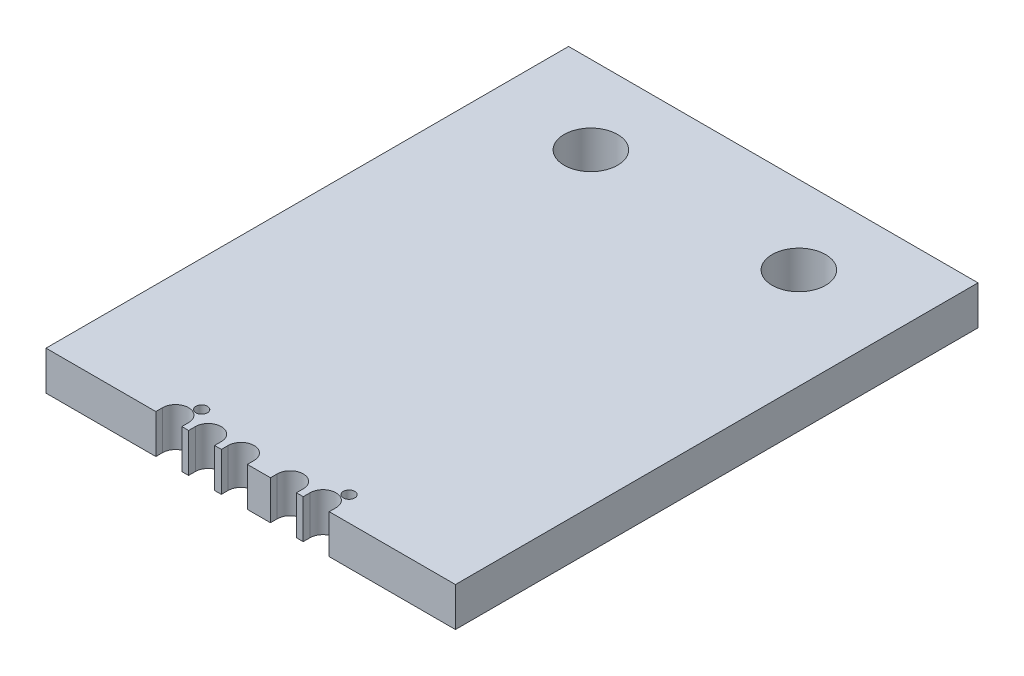
ISO-10303-21;
HEADER;
FILE_DESCRIPTION(('STEP AP214'),'2;1');
FILE_NAME('part.step','',(''),(''),'','','');
FILE_SCHEMA(('AUTOMOTIVE_DESIGN { 1 0 10303 214 1 1 1 1 }'));
ENDSEC;
DATA;
#1=APPLICATION_CONTEXT('core data for automotive mechanical design processes');
#2=APPLICATION_PROTOCOL_DEFINITION('international standard','automotive_design',2000,#1);
#3=PRODUCT_CONTEXT('',#1,'mechanical');
#4=PRODUCT('Part','Part','',(#3));
#5=PRODUCT_RELATED_PRODUCT_CATEGORY('part','',(#4));
#6=PRODUCT_DEFINITION_FORMATION('','',#4);
#7=PRODUCT_DEFINITION_CONTEXT('part definition',#1,'design');
#8=PRODUCT_DEFINITION('design','',#6,#7);
#9=PRODUCT_DEFINITION_SHAPE('','',#8);
#10=(LENGTH_UNIT() NAMED_UNIT(*) SI_UNIT(.MILLI.,.METRE.));
#11=(NAMED_UNIT(*) PLANE_ANGLE_UNIT() SI_UNIT($,.RADIAN.));
#12=(NAMED_UNIT(*) SI_UNIT($,.STERADIAN.) SOLID_ANGLE_UNIT());
#13=UNCERTAINTY_MEASURE_WITH_UNIT(LENGTH_MEASURE(1.E-05),#10,'distance_accuracy_value','');
#14=(GEOMETRIC_REPRESENTATION_CONTEXT(3) GLOBAL_UNCERTAINTY_ASSIGNED_CONTEXT((#13)) GLOBAL_UNIT_ASSIGNED_CONTEXT((#10,
#11,#12)) REPRESENTATION_CONTEXT('',''));
#15=CARTESIAN_POINT('',(0.,0.,0.));
#16=DIRECTION('',(0.,0.,1.));
#17=DIRECTION('',(1.,0.,0.));
#18=AXIS2_PLACEMENT_3D('',#15,#16,#17);
#19=CARTESIAN_POINT('',(16.,-4.7625,-1.18513126604703));
#20=DIRECTION('',(0.,0.,1.));
#21=DIRECTION('',(1.,0.,0.));
#22=AXIS2_PLACEMENT_3D('',#19,#20,#21);
#23=PLANE('',#22);
#24=DIRECTION('',(1.,0.,0.));
#25=VECTOR('',#24,1.);
#26=CARTESIAN_POINT('',(16.,0.,-1.18513126604703));
#27=LINE('',#26,#25);
#28=CARTESIAN_POINT('',(16.,0.,-1.18513126604703));
#29=VERTEX_POINT('',#28);
#30=CARTESIAN_POINT('',(29.4125,0.,-1.18513126604703));
#31=VERTEX_POINT('',#30);
#32=EDGE_CURVE('E235',#29,#31,#27,.T.);
#33=ORIENTED_EDGE('',*,*,#32,.F.);
#34=DIRECTION('',(0.,1.,0.));
#35=VECTOR('',#34,1.);
#36=CARTESIAN_POINT('',(16.,-4.7625,-1.18513126604703));
#37=LINE('',#36,#35);
#38=CARTESIAN_POINT('',(16.,-4.7625,-1.18513126604703));
#39=VERTEX_POINT('',#38);
#40=EDGE_CURVE('E13',#39,#29,#37,.T.);
#41=ORIENTED_EDGE('',*,*,#40,.F.);
#42=DIRECTION('',(1.,0.,0.));
#43=VECTOR('',#42,1.);
#44=CARTESIAN_POINT('',(16.,-4.7625,-1.18513126604703));
#45=LINE('',#44,#43);
#46=CARTESIAN_POINT('',(29.4125,-4.7625,-1.18513126604703));
#47=VERTEX_POINT('',#46);
#48=EDGE_CURVE('E304',#39,#47,#45,.T.);
#49=ORIENTED_EDGE('',*,*,#48,.T.);
#50=DIRECTION('',(0.,1.,0.));
#51=VECTOR('',#50,1.);
#52=CARTESIAN_POINT('',(29.4125,-4.7625,-1.18513126604703));
#53=LINE('',#52,#51);
#54=EDGE_CURVE('E45',#47,#31,#53,.T.);
#55=ORIENTED_EDGE('',*,*,#54,.T.);
#56=EDGE_LOOP('',(#33,#41,#49,#55));
#57=FACE_BOUND('',#56,.T.);
#58=ADVANCED_FACE('F42',(#57),#23,.T.);
#59=CARTESIAN_POINT('',(16.,-4.7625,-1.18513126604703));
#60=DIRECTION('',(-1.,0.,0.));
#61=DIRECTION('',(0.,0.,1.));
#62=AXIS2_PLACEMENT_3D('',#59,#60,#61);
#63=PLANE('',#62);
#64=DIRECTION('',(0.,0.,1.));
#65=VECTOR('',#64,1.);
#66=CARTESIAN_POINT('',(16.,0.,-1.18513126604703));
#67=LINE('',#66,#65);
#68=CARTESIAN_POINT('',(16.,0.,-65.));
#69=VERTEX_POINT('',#68);
#70=EDGE_CURVE('E302',#69,#29,#67,.T.);
#71=ORIENTED_EDGE('',*,*,#70,.F.);
#72=DIRECTION('',(0.,1.,0.));
#73=VECTOR('',#72,1.);
#74=CARTESIAN_POINT('',(16.,-4.7625,-65.));
#75=LINE('',#74,#73);
#76=CARTESIAN_POINT('',(16.,-4.7625,-65.));
#77=VERTEX_POINT('',#76);
#78=EDGE_CURVE('E51',#77,#69,#75,.T.);
#79=ORIENTED_EDGE('',*,*,#78,.F.);
#80=DIRECTION('',(0.,0.,1.));
#81=VECTOR('',#80,1.);
#82=CARTESIAN_POINT('',(16.,-4.7625,-1.18513126604703));
#83=LINE('',#82,#81);
#84=EDGE_CURVE('E225',#77,#39,#83,.T.);
#85=ORIENTED_EDGE('',*,*,#84,.T.);
#86=ORIENTED_EDGE('',*,*,#40,.T.);
#87=EDGE_LOOP('',(#71,#79,#85,#86));
#88=FACE_BOUND('',#87,.T.);
#89=ADVANCED_FACE('F348',(#88),#63,.T.);
#90=CARTESIAN_POINT('',(16.,-4.7625,-65.));
#91=DIRECTION('',(0.,0.,-1.));
#92=DIRECTION('',(-1.,0.,0.));
#93=AXIS2_PLACEMENT_3D('',#90,#91,#92);
#94=PLANE('',#93);
#95=DIRECTION('',(-1.,0.,0.));
#96=VECTOR('',#95,1.);
#97=CARTESIAN_POINT('',(16.,0.,-65.));
#98=LINE('',#97,#96);
#99=CARTESIAN_POINT('',(66.,0.,-65.));
#100=VERTEX_POINT('',#99);
#101=EDGE_CURVE('E212',#100,#69,#98,.T.);
#102=ORIENTED_EDGE('',*,*,#101,.F.);
#103=DIRECTION('',(0.,1.,0.));
#104=VECTOR('',#103,1.);
#105=CARTESIAN_POINT('',(66.,-4.7625,-65.));
#106=LINE('',#105,#104);
#107=CARTESIAN_POINT('',(66.,-4.7625,-65.));
#108=VERTEX_POINT('',#107);
#109=EDGE_CURVE('E207',#108,#100,#106,.T.);
#110=ORIENTED_EDGE('',*,*,#109,.F.);
#111=DIRECTION('',(-1.,0.,0.));
#112=VECTOR('',#111,1.);
#113=CARTESIAN_POINT('',(16.,-4.7625,-65.));
#114=LINE('',#113,#112);
#115=EDGE_CURVE('E210',#108,#77,#114,.T.);
#116=ORIENTED_EDGE('',*,*,#115,.T.);
#117=ORIENTED_EDGE('',*,*,#78,.T.);
#118=EDGE_LOOP('',(#102,#110,#116,#117));
#119=FACE_BOUND('',#118,.T.);
#120=ADVANCED_FACE('F209',(#119),#94,.T.);
#121=CARTESIAN_POINT('',(66.,-4.7625,-1.18513126604705));
#122=DIRECTION('',(1.,0.,0.));
#123=DIRECTION('',(0.,0.,-1.));
#124=AXIS2_PLACEMENT_3D('',#121,#122,#123);
#125=PLANE('',#124);
#126=DIRECTION('',(0.,0.,-1.));
#127=VECTOR('',#126,1.);
#128=CARTESIAN_POINT('',(66.,0.,-1.18513126604705));
#129=LINE('',#128,#127);
#130=CARTESIAN_POINT('',(66.,0.,-1.18513126604705));
#131=VERTEX_POINT('',#130);
#132=EDGE_CURVE('E299',#131,#100,#129,.T.);
#133=ORIENTED_EDGE('',*,*,#132,.F.);
#134=DIRECTION('',(0.,1.,0.));
#135=VECTOR('',#134,1.);
#136=CARTESIAN_POINT('',(66.,-4.7625,-1.18513126604705));
#137=LINE('',#136,#135);
#138=CARTESIAN_POINT('',(66.,-4.7625,-1.18513126604705));
#139=VERTEX_POINT('',#138);
#140=EDGE_CURVE('E217',#139,#131,#137,.T.);
#141=ORIENTED_EDGE('',*,*,#140,.F.);
#142=DIRECTION('',(0.,0.,-1.));
#143=VECTOR('',#142,1.);
#144=CARTESIAN_POINT('',(66.,-4.7625,-1.18513126604705));
#145=LINE('',#144,#143);
#146=EDGE_CURVE('E223',#139,#108,#145,.T.);
#147=ORIENTED_EDGE('',*,*,#146,.T.);
#148=ORIENTED_EDGE('',*,*,#109,.T.);
#149=EDGE_LOOP('',(#133,#141,#147,#148));
#150=FACE_BOUND('',#149,.T.);
#151=ADVANCED_FACE('F227',(#150),#125,.T.);
#152=CARTESIAN_POINT('',(50.5875,-4.7625,-1.18513126604703));
#153=DIRECTION('',(0.,0.,1.));
#154=DIRECTION('',(1.,0.,0.));
#155=AXIS2_PLACEMENT_3D('',#152,#153,#154);
#156=PLANE('',#155);
#157=DIRECTION('',(1.,0.,0.));
#158=VECTOR('',#157,1.);
#159=CARTESIAN_POINT('',(50.5875,0.,-1.18513126604703));
#160=LINE('',#159,#158);
#161=CARTESIAN_POINT('',(50.5875,0.,-1.18513126604703));
#162=VERTEX_POINT('',#161);
#163=EDGE_CURVE('E296',#162,#131,#160,.T.);
#164=ORIENTED_EDGE('',*,*,#163,.F.);
#165=DIRECTION('',(0.,1.,0.));
#166=VECTOR('',#165,1.);
#167=CARTESIAN_POINT('',(50.5875,-4.7625,-1.18513126604703));
#168=LINE('',#167,#166);
#169=CARTESIAN_POINT('',(50.5875,-4.7625,-1.18513126604703));
#170=VERTEX_POINT('',#169);
#171=EDGE_CURVE('E308',#170,#162,#168,.T.);
#172=ORIENTED_EDGE('',*,*,#171,.F.);
#173=DIRECTION('',(1.,0.,0.));
#174=VECTOR('',#173,1.);
#175=CARTESIAN_POINT('',(50.5875,-4.7625,-1.18513126604703));
#176=LINE('',#175,#174);
#177=EDGE_CURVE('E228',#170,#139,#176,.T.);
#178=ORIENTED_EDGE('',*,*,#177,.T.);
#179=ORIENTED_EDGE('',*,*,#140,.T.);
#180=EDGE_LOOP('',(#164,#172,#178,#179));
#181=FACE_BOUND('',#180,.T.);
#182=ADVANCED_FACE('F361',(#181),#156,.T.);
#183=CARTESIAN_POINT('',(50.5875,-4.7625,-2.00982745948582));
#184=DIRECTION('',(-1.,0.,0.));
#185=DIRECTION('',(0.,0.,1.));
#186=AXIS2_PLACEMENT_3D('',#183,#184,#185);
#187=PLANE('',#186);
#188=DIRECTION('',(0.,0.,1.));
#189=VECTOR('',#188,1.);
#190=CARTESIAN_POINT('',(50.5875,0.,-2.00982745948582));
#191=LINE('',#190,#189);
#192=CARTESIAN_POINT('',(50.5875,0.,-2.00982745948582));
#193=VERTEX_POINT('',#192);
#194=EDGE_CURVE('E293',#193,#162,#191,.T.);
#195=ORIENTED_EDGE('',*,*,#194,.F.);
#196=DIRECTION('',(0.,1.,0.));
#197=VECTOR('',#196,1.);
#198=CARTESIAN_POINT('',(50.5875,-4.7625,-2.00982745948582));
#199=LINE('',#198,#197);
#200=CARTESIAN_POINT('',(50.5875,-4.7625,-2.00982745948582));
#201=VERTEX_POINT('',#200);
#202=EDGE_CURVE('E310',#201,#193,#199,.T.);
#203=ORIENTED_EDGE('',*,*,#202,.F.);
#204=DIRECTION('',(0.,0.,1.));
#205=VECTOR('',#204,1.);
#206=CARTESIAN_POINT('',(50.5875,-4.7625,-2.00982745948582));
#207=LINE('',#206,#205);
#208=EDGE_CURVE('E230',#201,#170,#207,.T.);
#209=ORIENTED_EDGE('',*,*,#208,.T.);
#210=ORIENTED_EDGE('',*,*,#171,.T.);
#211=EDGE_LOOP('',(#195,#203,#209,#210));
#212=FACE_BOUND('',#211,.T.);
#213=ADVANCED_FACE('F364',(#212),#187,.T.);
#214=CARTESIAN_POINT('',(49.,-4.7625,-2.00982745948582));
#215=DIRECTION('',(0.,1.,0.));
#216=DIRECTION('',(0.,0.,1.));
#217=AXIS2_PLACEMENT_3D('',#214,#215,#216);
#218=CYLINDRICAL_SURFACE('',#217,1.5875);
#219=CARTESIAN_POINT('',(49.,0.,-2.00982745948582));
#220=DIRECTION('',(0.,-1.,0.));
#221=DIRECTION('',(0.,0.,-1.));
#222=AXIS2_PLACEMENT_3D('',#219,#220,#221);
#223=CIRCLE('',#222,1.5875);
#224=CARTESIAN_POINT('',(47.4125,0.,-2.00982745948582));
#225=VERTEX_POINT('',#224);
#226=EDGE_CURVE('E290',#225,#193,#223,.T.);
#227=ORIENTED_EDGE('',*,*,#226,.F.);
#228=DIRECTION('',(0.,1.,0.));
#229=VECTOR('',#228,1.);
#230=CARTESIAN_POINT('',(47.4125,-4.7625,-2.00982745948582));
#231=LINE('',#230,#229);
#232=CARTESIAN_POINT('',(47.4125,-4.7625,-2.00982745948582));
#233=VERTEX_POINT('',#232);
#234=EDGE_CURVE('E312',#233,#225,#231,.T.);
#235=ORIENTED_EDGE('',*,*,#234,.F.);
#236=CARTESIAN_POINT('',(49.,-4.7625,-2.00982745948582));
#237=DIRECTION('',(0.,-1.,0.));
#238=DIRECTION('',(0.,0.,-1.));
#239=AXIS2_PLACEMENT_3D('',#236,#237,#238);
#240=CIRCLE('',#239,1.5875);
#241=EDGE_CURVE('E542',#233,#201,#240,.T.);
#242=ORIENTED_EDGE('',*,*,#241,.T.);
#243=ORIENTED_EDGE('',*,*,#202,.T.);
#244=EDGE_LOOP('',(#227,#235,#242,#243));
#245=FACE_BOUND('',#244,.T.);
#246=ADVANCED_FACE('F368',(#245),#218,.F.);
#247=CARTESIAN_POINT('',(47.4125,-4.7625,-1.18513126604703));
#248=DIRECTION('',(1.,0.,0.));
#249=DIRECTION('',(0.,0.,-1.));
#250=AXIS2_PLACEMENT_3D('',#247,#248,#249);
#251=PLANE('',#250);
#252=DIRECTION('',(0.,0.,-1.));
#253=VECTOR('',#252,1.);
#254=CARTESIAN_POINT('',(47.4125,0.,-1.18513126604703));
#255=LINE('',#254,#253);
#256=CARTESIAN_POINT('',(47.4125,0.,-1.18513126604703));
#257=VERTEX_POINT('',#256);
#258=EDGE_CURVE('E287',#257,#225,#255,.T.);
#259=ORIENTED_EDGE('',*,*,#258,.F.);
#260=DIRECTION('',(0.,1.,0.));
#261=VECTOR('',#260,1.);
#262=CARTESIAN_POINT('',(47.4125,-4.7625,-1.18513126604703));
#263=LINE('',#262,#261);
#264=CARTESIAN_POINT('',(47.4125,-4.7625,-1.18513126604703));
#265=VERTEX_POINT('',#264);
#266=EDGE_CURVE('E314',#265,#257,#263,.T.);
#267=ORIENTED_EDGE('',*,*,#266,.F.);
#268=DIRECTION('',(0.,0.,-1.));
#269=VECTOR('',#268,1.);
#270=CARTESIAN_POINT('',(47.4125,-4.7625,-1.18513126604703));
#271=LINE('',#270,#269);
#272=EDGE_CURVE('E539',#265,#233,#271,.T.);
#273=ORIENTED_EDGE('',*,*,#272,.T.);
#274=ORIENTED_EDGE('',*,*,#234,.T.);
#275=EDGE_LOOP('',(#259,#267,#273,#274));
#276=FACE_BOUND('',#275,.T.);
#277=ADVANCED_FACE('F372',(#276),#251,.T.);
#278=CARTESIAN_POINT('',(46.5875,-4.7625,-1.18513126604703));
#279=DIRECTION('',(0.,0.,1.));
#280=DIRECTION('',(1.,0.,0.));
#281=AXIS2_PLACEMENT_3D('',#278,#279,#280);
#282=PLANE('',#281);
#283=DIRECTION('',(1.,0.,0.));
#284=VECTOR('',#283,1.);
#285=CARTESIAN_POINT('',(46.5875,0.,-1.18513126604703));
#286=LINE('',#285,#284);
#287=CARTESIAN_POINT('',(46.5875,0.,-1.18513126604703));
#288=VERTEX_POINT('',#287);
#289=EDGE_CURVE('E284',#288,#257,#286,.T.);
#290=ORIENTED_EDGE('',*,*,#289,.F.);
#291=DIRECTION('',(0.,1.,0.));
#292=VECTOR('',#291,1.);
#293=CARTESIAN_POINT('',(46.5875,-4.7625,-1.18513126604703));
#294=LINE('',#293,#292);
#295=CARTESIAN_POINT('',(46.5875,-4.7625,-1.18513126604703));
#296=VERTEX_POINT('',#295);
#297=EDGE_CURVE('E316',#296,#288,#294,.T.);
#298=ORIENTED_EDGE('',*,*,#297,.F.);
#299=DIRECTION('',(1.,0.,0.));
#300=VECTOR('',#299,1.);
#301=CARTESIAN_POINT('',(46.5875,-4.7625,-1.18513126604703));
#302=LINE('',#301,#300);
#303=EDGE_CURVE('E536',#296,#265,#302,.T.);
#304=ORIENTED_EDGE('',*,*,#303,.T.);
#305=ORIENTED_EDGE('',*,*,#266,.T.);
#306=EDGE_LOOP('',(#290,#298,#304,#305));
#307=FACE_BOUND('',#306,.T.);
#308=ADVANCED_FACE('F376',(#307),#282,.T.);
#309=CARTESIAN_POINT('',(46.5875,-4.7625,-2.00982745948582));
#310=DIRECTION('',(-1.,0.,0.));
#311=DIRECTION('',(0.,0.,1.));
#312=AXIS2_PLACEMENT_3D('',#309,#310,#311);
#313=PLANE('',#312);
#314=DIRECTION('',(0.,0.,1.));
#315=VECTOR('',#314,1.);
#316=CARTESIAN_POINT('',(46.5875,0.,-2.00982745948582));
#317=LINE('',#316,#315);
#318=CARTESIAN_POINT('',(46.5875,0.,-2.00982745948582));
#319=VERTEX_POINT('',#318);
#320=EDGE_CURVE('E281',#319,#288,#317,.T.);
#321=ORIENTED_EDGE('',*,*,#320,.F.);
#322=DIRECTION('',(0.,1.,0.));
#323=VECTOR('',#322,1.);
#324=CARTESIAN_POINT('',(46.5875,-4.7625,-2.00982745948582));
#325=LINE('',#324,#323);
#326=CARTESIAN_POINT('',(46.5875,-4.7625,-2.00982745948582));
#327=VERTEX_POINT('',#326);
#328=EDGE_CURVE('E318',#327,#319,#325,.T.);
#329=ORIENTED_EDGE('',*,*,#328,.F.);
#330=DIRECTION('',(0.,0.,1.));
#331=VECTOR('',#330,1.);
#332=CARTESIAN_POINT('',(46.5875,-4.7625,-2.00982745948582));
#333=LINE('',#332,#331);
#334=EDGE_CURVE('E533',#327,#296,#333,.T.);
#335=ORIENTED_EDGE('',*,*,#334,.T.);
#336=ORIENTED_EDGE('',*,*,#297,.T.);
#337=EDGE_LOOP('',(#321,#329,#335,#336));
#338=FACE_BOUND('',#337,.T.);
#339=ADVANCED_FACE('F380',(#338),#313,.T.);
#340=CARTESIAN_POINT('',(45.,-4.7625,-2.00982745948582));
#341=DIRECTION('',(0.,1.,0.));
#342=DIRECTION('',(0.,0.,1.));
#343=AXIS2_PLACEMENT_3D('',#340,#341,#342);
#344=CYLINDRICAL_SURFACE('',#343,1.5875);
#345=CARTESIAN_POINT('',(45.,0.,-2.00982745948582));
#346=DIRECTION('',(0.,-1.,0.));
#347=DIRECTION('',(0.,0.,-1.));
#348=AXIS2_PLACEMENT_3D('',#345,#346,#347);
#349=CIRCLE('',#348,1.5875);
#350=CARTESIAN_POINT('',(43.4125,0.,-2.00982745948582));
#351=VERTEX_POINT('',#350);
#352=EDGE_CURVE('E278',#351,#319,#349,.T.);
#353=ORIENTED_EDGE('',*,*,#352,.F.);
#354=DIRECTION('',(0.,1.,0.));
#355=VECTOR('',#354,1.);
#356=CARTESIAN_POINT('',(43.4125,-4.7625,-2.00982745948582));
#357=LINE('',#356,#355);
#358=CARTESIAN_POINT('',(43.4125,-4.7625,-2.00982745948582));
#359=VERTEX_POINT('',#358);
#360=EDGE_CURVE('E320',#359,#351,#357,.T.);
#361=ORIENTED_EDGE('',*,*,#360,.F.);
#362=CARTESIAN_POINT('',(45.,-4.7625,-2.00982745948582));
#363=DIRECTION('',(0.,-1.,0.));
#364=DIRECTION('',(0.,0.,-1.));
#365=AXIS2_PLACEMENT_3D('',#362,#363,#364);
#366=CIRCLE('',#365,1.5875);
#367=EDGE_CURVE('E530',#359,#327,#366,.T.);
#368=ORIENTED_EDGE('',*,*,#367,.T.);
#369=ORIENTED_EDGE('',*,*,#328,.T.);
#370=EDGE_LOOP('',(#353,#361,#368,#369));
#371=FACE_BOUND('',#370,.T.);
#372=ADVANCED_FACE('F384',(#371),#344,.F.);
#373=CARTESIAN_POINT('',(43.4125,-4.7625,-2.00982745948582));
#374=DIRECTION('',(1.,0.,0.));
#375=DIRECTION('',(0.,0.,-1.));
#376=AXIS2_PLACEMENT_3D('',#373,#374,#375);
#377=PLANE('',#376);
#378=DIRECTION('',(0.,0.,-1.));
#379=VECTOR('',#378,1.);
#380=CARTESIAN_POINT('',(43.4125,0.,-2.00982745948582));
#381=LINE('',#380,#379);
#382=CARTESIAN_POINT('',(43.4125,0.,-1.18513126604703));
#383=VERTEX_POINT('',#382);
#384=EDGE_CURVE('E275',#383,#351,#381,.T.);
#385=ORIENTED_EDGE('',*,*,#384,.F.);
#386=DIRECTION('',(0.,1.,0.));
#387=VECTOR('',#386,1.);
#388=CARTESIAN_POINT('',(43.4125,-4.7625,-1.18513126604703));
#389=LINE('',#388,#387);
#390=CARTESIAN_POINT('',(43.4125,-4.7625,-1.18513126604703));
#391=VERTEX_POINT('',#390);
#392=EDGE_CURVE('E322',#391,#383,#389,.T.);
#393=ORIENTED_EDGE('',*,*,#392,.F.);
#394=DIRECTION('',(0.,0.,-1.));
#395=VECTOR('',#394,1.);
#396=CARTESIAN_POINT('',(43.4125,-4.7625,-2.00982745948582));
#397=LINE('',#396,#395);
#398=EDGE_CURVE('E527',#391,#359,#397,.T.);
#399=ORIENTED_EDGE('',*,*,#398,.T.);
#400=ORIENTED_EDGE('',*,*,#360,.T.);
#401=EDGE_LOOP('',(#385,#393,#399,#400));
#402=FACE_BOUND('',#401,.T.);
#403=ADVANCED_FACE('F388',(#402),#377,.T.);
#404=CARTESIAN_POINT('',(43.4125,-4.7625,-1.18513126604703));
#405=DIRECTION('',(0.,0.,1.));
#406=DIRECTION('',(1.,0.,0.));
#407=AXIS2_PLACEMENT_3D('',#404,#405,#406);
#408=PLANE('',#407);
#409=DIRECTION('',(1.,0.,0.));
#410=VECTOR('',#409,1.);
#411=CARTESIAN_POINT('',(43.4125,0.,-1.18513126604703));
#412=LINE('',#411,#410);
#413=CARTESIAN_POINT('',(40.5875,0.,-1.18513126604703));
#414=VERTEX_POINT('',#413);
#415=EDGE_CURVE('E272',#414,#383,#412,.T.);
#416=ORIENTED_EDGE('',*,*,#415,.F.);
#417=DIRECTION('',(0.,1.,0.));
#418=VECTOR('',#417,1.);
#419=CARTESIAN_POINT('',(40.5875,-4.7625,-1.18513126604703));
#420=LINE('',#419,#418);
#421=CARTESIAN_POINT('',(40.5875,-4.7625,-1.18513126604703));
#422=VERTEX_POINT('',#421);
#423=EDGE_CURVE('E324',#422,#414,#420,.T.);
#424=ORIENTED_EDGE('',*,*,#423,.F.);
#425=DIRECTION('',(1.,0.,0.));
#426=VECTOR('',#425,1.);
#427=CARTESIAN_POINT('',(43.4125,-4.7625,-1.18513126604703));
#428=LINE('',#427,#426);
#429=EDGE_CURVE('E524',#422,#391,#428,.T.);
#430=ORIENTED_EDGE('',*,*,#429,.T.);
#431=ORIENTED_EDGE('',*,*,#392,.T.);
#432=EDGE_LOOP('',(#416,#424,#430,#431));
#433=FACE_BOUND('',#432,.T.);
#434=ADVANCED_FACE('F392',(#433),#408,.T.);
#435=CARTESIAN_POINT('',(40.5875,-4.7625,-1.18513126604703));
#436=DIRECTION('',(-1.,0.,0.));
#437=DIRECTION('',(0.,0.,1.));
#438=AXIS2_PLACEMENT_3D('',#435,#436,#437);
#439=PLANE('',#438);
#440=DIRECTION('',(0.,0.,1.));
#441=VECTOR('',#440,1.);
#442=CARTESIAN_POINT('',(40.5875,0.,-1.18513126604703));
#443=LINE('',#442,#441);
#444=CARTESIAN_POINT('',(40.5875,0.,-2.00982745948582));
#445=VERTEX_POINT('',#444);
#446=EDGE_CURVE('E269',#445,#414,#443,.T.);
#447=ORIENTED_EDGE('',*,*,#446,.F.);
#448=DIRECTION('',(0.,1.,0.));
#449=VECTOR('',#448,1.);
#450=CARTESIAN_POINT('',(40.5875,-4.7625,-2.00982745948582));
#451=LINE('',#450,#449);
#452=CARTESIAN_POINT('',(40.5875,-4.7625,-2.00982745948582));
#453=VERTEX_POINT('',#452);
#454=EDGE_CURVE('E326',#453,#445,#451,.T.);
#455=ORIENTED_EDGE('',*,*,#454,.F.);
#456=DIRECTION('',(0.,0.,1.));
#457=VECTOR('',#456,1.);
#458=CARTESIAN_POINT('',(40.5875,-4.7625,-1.18513126604703));
#459=LINE('',#458,#457);
#460=EDGE_CURVE('E521',#453,#422,#459,.T.);
#461=ORIENTED_EDGE('',*,*,#460,.T.);
#462=ORIENTED_EDGE('',*,*,#423,.T.);
#463=EDGE_LOOP('',(#447,#455,#461,#462));
#464=FACE_BOUND('',#463,.T.);
#465=ADVANCED_FACE('F396',(#464),#439,.T.);
#466=CARTESIAN_POINT('',(39.,-4.7625,-2.00982745948582));
#467=DIRECTION('',(0.,1.,0.));
#468=DIRECTION('',(0.,0.,1.));
#469=AXIS2_PLACEMENT_3D('',#466,#467,#468);
#470=CYLINDRICAL_SURFACE('',#469,1.5875);
#471=CARTESIAN_POINT('',(39.,0.,-2.00982745948582));
#472=DIRECTION('',(0.,-1.,0.));
#473=DIRECTION('',(0.,0.,-1.));
#474=AXIS2_PLACEMENT_3D('',#471,#472,#473);
#475=CIRCLE('',#474,1.5875);
#476=CARTESIAN_POINT('',(37.4125,0.,-2.00982745948582));
#477=VERTEX_POINT('',#476);
#478=EDGE_CURVE('E266',#477,#445,#475,.T.);
#479=ORIENTED_EDGE('',*,*,#478,.F.);
#480=DIRECTION('',(0.,1.,0.));
#481=VECTOR('',#480,1.);
#482=CARTESIAN_POINT('',(37.4125,-4.7625,-2.00982745948582));
#483=LINE('',#482,#481);
#484=CARTESIAN_POINT('',(37.4125,-4.7625,-2.00982745948582));
#485=VERTEX_POINT('',#484);
#486=EDGE_CURVE('E328',#485,#477,#483,.T.);
#487=ORIENTED_EDGE('',*,*,#486,.F.);
#488=CARTESIAN_POINT('',(39.,-4.7625,-2.00982745948582));
#489=DIRECTION('',(0.,-1.,0.));
#490=DIRECTION('',(0.,0.,-1.));
#491=AXIS2_PLACEMENT_3D('',#488,#489,#490);
#492=CIRCLE('',#491,1.5875);
#493=EDGE_CURVE('E518',#485,#453,#492,.T.);
#494=ORIENTED_EDGE('',*,*,#493,.T.);
#495=ORIENTED_EDGE('',*,*,#454,.T.);
#496=EDGE_LOOP('',(#479,#487,#494,#495));
#497=FACE_BOUND('',#496,.T.);
#498=ADVANCED_FACE('F400',(#497),#470,.F.);
#499=CARTESIAN_POINT('',(37.4125,-4.7625,-2.00982745948582));
#500=DIRECTION('',(1.,0.,0.));
#501=DIRECTION('',(0.,0.,-1.));
#502=AXIS2_PLACEMENT_3D('',#499,#500,#501);
#503=PLANE('',#502);
#504=DIRECTION('',(0.,0.,-1.));
#505=VECTOR('',#504,1.);
#506=CARTESIAN_POINT('',(37.4125,0.,-2.00982745948582));
#507=LINE('',#506,#505);
#508=CARTESIAN_POINT('',(37.4125,0.,-1.18513126604703));
#509=VERTEX_POINT('',#508);
#510=EDGE_CURVE('E263',#509,#477,#507,.T.);
#511=ORIENTED_EDGE('',*,*,#510,.F.);
#512=DIRECTION('',(0.,1.,0.));
#513=VECTOR('',#512,1.);
#514=CARTESIAN_POINT('',(37.4125,-4.7625,-1.18513126604703));
#515=LINE('',#514,#513);
#516=CARTESIAN_POINT('',(37.4125,-4.7625,-1.18513126604703));
#517=VERTEX_POINT('',#516);
#518=EDGE_CURVE('E330',#517,#509,#515,.T.);
#519=ORIENTED_EDGE('',*,*,#518,.F.);
#520=DIRECTION('',(0.,0.,-1.));
#521=VECTOR('',#520,1.);
#522=CARTESIAN_POINT('',(37.4125,-4.7625,-2.00982745948582));
#523=LINE('',#522,#521);
#524=EDGE_CURVE('E515',#517,#485,#523,.T.);
#525=ORIENTED_EDGE('',*,*,#524,.T.);
#526=ORIENTED_EDGE('',*,*,#486,.T.);
#527=EDGE_LOOP('',(#511,#519,#525,#526));
#528=FACE_BOUND('',#527,.T.);
#529=ADVANCED_FACE('F404',(#528),#503,.T.);
#530=CARTESIAN_POINT('',(37.4125,-4.7625,-1.18513126604703));
#531=DIRECTION('',(0.,0.,1.));
#532=DIRECTION('',(1.,0.,0.));
#533=AXIS2_PLACEMENT_3D('',#530,#531,#532);
#534=PLANE('',#533);
#535=DIRECTION('',(1.,0.,0.));
#536=VECTOR('',#535,1.);
#537=CARTESIAN_POINT('',(37.4125,0.,-1.18513126604703));
#538=LINE('',#537,#536);
#539=CARTESIAN_POINT('',(36.5875,0.,-1.18513126604703));
#540=VERTEX_POINT('',#539);
#541=EDGE_CURVE('E260',#540,#509,#538,.T.);
#542=ORIENTED_EDGE('',*,*,#541,.F.);
#543=DIRECTION('',(0.,1.,0.));
#544=VECTOR('',#543,1.);
#545=CARTESIAN_POINT('',(36.5875,-4.7625,-1.18513126604703));
#546=LINE('',#545,#544);
#547=CARTESIAN_POINT('',(36.5875,-4.7625,-1.18513126604703));
#548=VERTEX_POINT('',#547);
#549=EDGE_CURVE('E332',#548,#540,#546,.T.);
#550=ORIENTED_EDGE('',*,*,#549,.F.);
#551=DIRECTION('',(1.,0.,0.));
#552=VECTOR('',#551,1.);
#553=CARTESIAN_POINT('',(37.4125,-4.7625,-1.18513126604703));
#554=LINE('',#553,#552);
#555=EDGE_CURVE('E512',#548,#517,#554,.T.);
#556=ORIENTED_EDGE('',*,*,#555,.T.);
#557=ORIENTED_EDGE('',*,*,#518,.T.);
#558=EDGE_LOOP('',(#542,#550,#556,#557));
#559=FACE_BOUND('',#558,.T.);
#560=ADVANCED_FACE('F408',(#559),#534,.T.);
#561=CARTESIAN_POINT('',(36.5875,-4.7625,-1.18513126604703));
#562=DIRECTION('',(-1.,0.,0.));
#563=DIRECTION('',(0.,0.,1.));
#564=AXIS2_PLACEMENT_3D('',#561,#562,#563);
#565=PLANE('',#564);
#566=DIRECTION('',(0.,0.,1.));
#567=VECTOR('',#566,1.);
#568=CARTESIAN_POINT('',(36.5875,0.,-1.18513126604703));
#569=LINE('',#568,#567);
#570=CARTESIAN_POINT('',(36.5875,0.,-2.00982745948582));
#571=VERTEX_POINT('',#570);
#572=EDGE_CURVE('E257',#571,#540,#569,.T.);
#573=ORIENTED_EDGE('',*,*,#572,.F.);
#574=DIRECTION('',(0.,1.,0.));
#575=VECTOR('',#574,1.);
#576=CARTESIAN_POINT('',(36.5875,-4.7625,-2.00982745948582));
#577=LINE('',#576,#575);
#578=CARTESIAN_POINT('',(36.5875,-4.7625,-2.00982745948582));
#579=VERTEX_POINT('',#578);
#580=EDGE_CURVE('E334',#579,#571,#577,.T.);
#581=ORIENTED_EDGE('',*,*,#580,.F.);
#582=DIRECTION('',(0.,0.,1.));
#583=VECTOR('',#582,1.);
#584=CARTESIAN_POINT('',(36.5875,-4.7625,-1.18513126604703));
#585=LINE('',#584,#583);
#586=EDGE_CURVE('E509',#579,#548,#585,.T.);
#587=ORIENTED_EDGE('',*,*,#586,.T.);
#588=ORIENTED_EDGE('',*,*,#549,.T.);
#589=EDGE_LOOP('',(#573,#581,#587,#588));
#590=FACE_BOUND('',#589,.T.);
#591=ADVANCED_FACE('F412',(#590),#565,.T.);
#592=CARTESIAN_POINT('',(35.,-4.7625,-2.00982745948582));
#593=DIRECTION('',(0.,1.,0.));
#594=DIRECTION('',(0.,0.,1.));
#595=AXIS2_PLACEMENT_3D('',#592,#593,#594);
#596=CYLINDRICAL_SURFACE('',#595,1.5875);
#597=CARTESIAN_POINT('',(35.,0.,-2.00982745948582));
#598=DIRECTION('',(0.,-1.,0.));
#599=DIRECTION('',(0.,0.,-1.));
#600=AXIS2_PLACEMENT_3D('',#597,#598,#599);
#601=CIRCLE('',#600,1.5875);
#602=CARTESIAN_POINT('',(33.4125,0.,-2.00982745948582));
#603=VERTEX_POINT('',#602);
#604=EDGE_CURVE('E254',#603,#571,#601,.T.);
#605=ORIENTED_EDGE('',*,*,#604,.F.);
#606=DIRECTION('',(0.,1.,0.));
#607=VECTOR('',#606,1.);
#608=CARTESIAN_POINT('',(33.4125,-4.7625,-2.00982745948582));
#609=LINE('',#608,#607);
#610=CARTESIAN_POINT('',(33.4125,-4.7625,-2.00982745948582));
#611=VERTEX_POINT('',#610);
#612=EDGE_CURVE('E336',#611,#603,#609,.T.);
#613=ORIENTED_EDGE('',*,*,#612,.F.);
#614=CARTESIAN_POINT('',(35.,-4.7625,-2.00982745948582));
#615=DIRECTION('',(0.,-1.,0.));
#616=DIRECTION('',(0.,0.,-1.));
#617=AXIS2_PLACEMENT_3D('',#614,#615,#616);
#618=CIRCLE('',#617,1.5875);
#619=EDGE_CURVE('E506',#611,#579,#618,.T.);
#620=ORIENTED_EDGE('',*,*,#619,.T.);
#621=ORIENTED_EDGE('',*,*,#580,.T.);
#622=EDGE_LOOP('',(#605,#613,#620,#621));
#623=FACE_BOUND('',#622,.T.);
#624=ADVANCED_FACE('F416',(#623),#596,.F.);
#625=CARTESIAN_POINT('',(33.4125,-4.7625,-2.00982745948582));
#626=DIRECTION('',(1.,0.,0.));
#627=DIRECTION('',(0.,0.,-1.));
#628=AXIS2_PLACEMENT_3D('',#625,#626,#627);
#629=PLANE('',#628);
#630=DIRECTION('',(0.,0.,-1.));
#631=VECTOR('',#630,1.);
#632=CARTESIAN_POINT('',(33.4125,0.,-2.00982745948582));
#633=LINE('',#632,#631);
#634=CARTESIAN_POINT('',(33.4125,0.,-1.18513126604703));
#635=VERTEX_POINT('',#634);
#636=EDGE_CURVE('E251',#635,#603,#633,.T.);
#637=ORIENTED_EDGE('',*,*,#636,.F.);
#638=DIRECTION('',(0.,1.,0.));
#639=VECTOR('',#638,1.);
#640=CARTESIAN_POINT('',(33.4125,-4.7625,-1.18513126604703));
#641=LINE('',#640,#639);
#642=CARTESIAN_POINT('',(33.4125,-4.7625,-1.18513126604703));
#643=VERTEX_POINT('',#642);
#644=EDGE_CURVE('E338',#643,#635,#641,.T.);
#645=ORIENTED_EDGE('',*,*,#644,.F.);
#646=DIRECTION('',(0.,0.,-1.));
#647=VECTOR('',#646,1.);
#648=CARTESIAN_POINT('',(33.4125,-4.7625,-2.00982745948582));
#649=LINE('',#648,#647);
#650=EDGE_CURVE('E503',#643,#611,#649,.T.);
#651=ORIENTED_EDGE('',*,*,#650,.T.);
#652=ORIENTED_EDGE('',*,*,#612,.T.);
#653=EDGE_LOOP('',(#637,#645,#651,#652));
#654=FACE_BOUND('',#653,.T.);
#655=ADVANCED_FACE('F420',(#654),#629,.T.);
#656=CARTESIAN_POINT('',(33.4125,-4.7625,-1.18513126604703));
#657=DIRECTION('',(0.,0.,1.));
#658=DIRECTION('',(1.,0.,0.));
#659=AXIS2_PLACEMENT_3D('',#656,#657,#658);
#660=PLANE('',#659);
#661=DIRECTION('',(1.,0.,0.));
#662=VECTOR('',#661,1.);
#663=CARTESIAN_POINT('',(33.4125,0.,-1.18513126604703));
#664=LINE('',#663,#662);
#665=CARTESIAN_POINT('',(32.5875,0.,-1.18513126604703));
#666=VERTEX_POINT('',#665);
#667=EDGE_CURVE('E248',#666,#635,#664,.T.);
#668=ORIENTED_EDGE('',*,*,#667,.F.);
#669=DIRECTION('',(0.,1.,0.));
#670=VECTOR('',#669,1.);
#671=CARTESIAN_POINT('',(32.5875,-4.7625,-1.18513126604703));
#672=LINE('',#671,#670);
#673=CARTESIAN_POINT('',(32.5875,-4.7625,-1.18513126604703));
#674=VERTEX_POINT('',#673);
#675=EDGE_CURVE('E340',#674,#666,#672,.T.);
#676=ORIENTED_EDGE('',*,*,#675,.F.);
#677=DIRECTION('',(1.,0.,0.));
#678=VECTOR('',#677,1.);
#679=CARTESIAN_POINT('',(33.4125,-4.7625,-1.18513126604703));
#680=LINE('',#679,#678);
#681=EDGE_CURVE('E500',#674,#643,#680,.T.);
#682=ORIENTED_EDGE('',*,*,#681,.T.);
#683=ORIENTED_EDGE('',*,*,#644,.T.);
#684=EDGE_LOOP('',(#668,#676,#682,#683));
#685=FACE_BOUND('',#684,.T.);
#686=ADVANCED_FACE('F424',(#685),#660,.T.);
#687=CARTESIAN_POINT('',(32.5875,-4.7625,-1.18513126604703));
#688=DIRECTION('',(-1.,0.,0.));
#689=DIRECTION('',(0.,0.,1.));
#690=AXIS2_PLACEMENT_3D('',#687,#688,#689);
#691=PLANE('',#690);
#692=DIRECTION('',(0.,0.,1.));
#693=VECTOR('',#692,1.);
#694=CARTESIAN_POINT('',(32.5875,0.,-1.18513126604703));
#695=LINE('',#694,#693);
#696=CARTESIAN_POINT('',(32.5875,0.,-2.00982745948582));
#697=VERTEX_POINT('',#696);
#698=EDGE_CURVE('E245',#697,#666,#695,.T.);
#699=ORIENTED_EDGE('',*,*,#698,.F.);
#700=DIRECTION('',(0.,1.,0.));
#701=VECTOR('',#700,1.);
#702=CARTESIAN_POINT('',(32.5875,-4.7625,-2.00982745948582));
#703=LINE('',#702,#701);
#704=CARTESIAN_POINT('',(32.5875,-4.7625,-2.00982745948582));
#705=VERTEX_POINT('',#704);
#706=EDGE_CURVE('E342',#705,#697,#703,.T.);
#707=ORIENTED_EDGE('',*,*,#706,.F.);
#708=DIRECTION('',(0.,0.,1.));
#709=VECTOR('',#708,1.);
#710=CARTESIAN_POINT('',(32.5875,-4.7625,-1.18513126604703));
#711=LINE('',#710,#709);
#712=EDGE_CURVE('E497',#705,#674,#711,.T.);
#713=ORIENTED_EDGE('',*,*,#712,.T.);
#714=ORIENTED_EDGE('',*,*,#675,.T.);
#715=EDGE_LOOP('',(#699,#707,#713,#714));
#716=FACE_BOUND('',#715,.T.);
#717=ADVANCED_FACE('F428',(#716),#691,.T.);
#718=CARTESIAN_POINT('',(31.,-4.7625,-2.00982745948582));
#719=DIRECTION('',(0.,1.,0.));
#720=DIRECTION('',(0.,0.,1.));
#721=AXIS2_PLACEMENT_3D('',#718,#719,#720);
#722=CYLINDRICAL_SURFACE('',#721,1.5875);
#723=CARTESIAN_POINT('',(31.,0.,-2.00982745948582));
#724=DIRECTION('',(0.,-1.,0.));
#725=DIRECTION('',(0.,0.,-1.));
#726=AXIS2_PLACEMENT_3D('',#723,#724,#725);
#727=CIRCLE('',#726,1.5875);
#728=CARTESIAN_POINT('',(29.4125,0.,-2.00982745948582));
#729=VERTEX_POINT('',#728);
#730=EDGE_CURVE('E242',#729,#697,#727,.T.);
#731=ORIENTED_EDGE('',*,*,#730,.F.);
#732=DIRECTION('',(0.,1.,0.));
#733=VECTOR('',#732,1.);
#734=CARTESIAN_POINT('',(29.4125,-4.7625,-2.00982745948582));
#735=LINE('',#734,#733);
#736=CARTESIAN_POINT('',(29.4125,-4.7625,-2.00982745948582));
#737=VERTEX_POINT('',#736);
#738=EDGE_CURVE('E343',#737,#729,#735,.T.);
#739=ORIENTED_EDGE('',*,*,#738,.F.);
#740=CARTESIAN_POINT('',(31.,-4.7625,-2.00982745948582));
#741=DIRECTION('',(0.,-1.,0.));
#742=DIRECTION('',(0.,0.,-1.));
#743=AXIS2_PLACEMENT_3D('',#740,#741,#742);
#744=CIRCLE('',#743,1.5875);
#745=EDGE_CURVE('E494',#737,#705,#744,.T.);
#746=ORIENTED_EDGE('',*,*,#745,.T.);
#747=ORIENTED_EDGE('',*,*,#706,.T.);
#748=EDGE_LOOP('',(#731,#739,#746,#747));
#749=FACE_BOUND('',#748,.T.);
#750=ADVANCED_FACE('F432',(#749),#722,.F.);
#751=CARTESIAN_POINT('',(29.4125,-4.7625,-1.18513126604703));
#752=DIRECTION('',(1.,0.,0.));
#753=DIRECTION('',(0.,0.,-1.));
#754=AXIS2_PLACEMENT_3D('',#751,#752,#753);
#755=PLANE('',#754);
#756=DIRECTION('',(0.,0.,-1.));
#757=VECTOR('',#756,1.);
#758=CARTESIAN_POINT('',(29.4125,0.,-1.18513126604703));
#759=LINE('',#758,#757);
#760=EDGE_CURVE('E238',#31,#729,#759,.T.);
#761=ORIENTED_EDGE('',*,*,#760,.F.);
#762=ORIENTED_EDGE('',*,*,#54,.F.);
#763=DIRECTION('',(0.,0.,-1.));
#764=VECTOR('',#763,1.);
#765=CARTESIAN_POINT('',(29.4125,-4.7625,-1.18513126604703));
#766=LINE('',#765,#764);
#767=EDGE_CURVE('E492',#47,#737,#766,.T.);
#768=ORIENTED_EDGE('',*,*,#767,.T.);
#769=ORIENTED_EDGE('',*,*,#738,.T.);
#770=EDGE_LOOP('',(#761,#762,#768,#769));
#771=FACE_BOUND('',#770,.T.);
#772=ADVANCED_FACE('F345',(#771),#755,.T.);
#773=CARTESIAN_POINT('',(31.,-4.7625,-2.00982745948582));
#774=DIRECTION('',(0.,-1.,0.));
#775=DIRECTION('',(0.,0.,-1.));
#776=AXIS2_PLACEMENT_3D('',#773,#774,#775);
#777=PLANE('',#776);
#778=CARTESIAN_POINT('',(28.3,-4.7625,-55.4261221037908));
#779=DIRECTION('',(0.,1.,0.));
#780=DIRECTION('',(0.,0.,1.));
#781=AXIS2_PLACEMENT_3D('',#778,#779,#780);
#782=CIRCLE('',#781,3.2639);
#783=CARTESIAN_POINT('',(28.3,-4.7625,-52.1622221037908));
#784=VERTEX_POINT('',#783);
#785=EDGE_CURVE('E467',#784,#784,#782,.T.);
#786=ORIENTED_EDGE('',*,*,#785,.T.);
#787=EDGE_LOOP('',(#786));
#788=FACE_BOUND('',#787,.T.);
#789=CARTESIAN_POINT('',(53.7,-4.7625,-55.4261221037908));
#790=DIRECTION('',(0.,1.,0.));
#791=DIRECTION('',(0.,0.,1.));
#792=AXIS2_PLACEMENT_3D('',#789,#790,#791);
#793=CIRCLE('',#792,3.2639);
#794=CARTESIAN_POINT('',(53.7,-4.7625,-52.1622221037908));
#795=VERTEX_POINT('',#794);
#796=EDGE_CURVE('E475',#795,#795,#793,.T.);
#797=ORIENTED_EDGE('',*,*,#796,.T.);
#798=EDGE_LOOP('',(#797));
#799=FACE_BOUND('',#798,.T.);
#800=CARTESIAN_POINT('',(32.,-4.7625,-4.19732745948582));
#801=DIRECTION('',(0.,1.,0.));
#802=DIRECTION('',(0.,0.,1.));
#803=AXIS2_PLACEMENT_3D('',#800,#801,#802);
#804=CIRCLE('',#803,0.700000000000001);
#805=CARTESIAN_POINT('',(32.,-4.7625,-3.49732745948582));
#806=VERTEX_POINT('',#805);
#807=EDGE_CURVE('E481',#806,#806,#804,.T.);
#808=ORIENTED_EDGE('',*,*,#807,.T.);
#809=EDGE_LOOP('',(#808));
#810=FACE_BOUND('',#809,.T.);
#811=CARTESIAN_POINT('',(50.,-4.7625,-4.19732745948582));
#812=DIRECTION('',(0.,1.,0.));
#813=DIRECTION('',(0.,0.,1.));
#814=AXIS2_PLACEMENT_3D('',#811,#812,#813);
#815=CIRCLE('',#814,0.700000000000001);
#816=CARTESIAN_POINT('',(50.,-4.7625,-3.49732745948582));
#817=VERTEX_POINT('',#816);
#818=EDGE_CURVE('E239',#817,#817,#815,.T.);
#819=ORIENTED_EDGE('',*,*,#818,.T.);
#820=EDGE_LOOP('',(#819));
#821=FACE_BOUND('',#820,.T.);
#822=ORIENTED_EDGE('',*,*,#48,.F.);
#823=ORIENTED_EDGE('',*,*,#84,.F.);
#824=ORIENTED_EDGE('',*,*,#115,.F.);
#825=ORIENTED_EDGE('',*,*,#146,.F.);
#826=ORIENTED_EDGE('',*,*,#177,.F.);
#827=ORIENTED_EDGE('',*,*,#208,.F.);
#828=ORIENTED_EDGE('',*,*,#241,.F.);
#829=ORIENTED_EDGE('',*,*,#272,.F.);
#830=ORIENTED_EDGE('',*,*,#303,.F.);
#831=ORIENTED_EDGE('',*,*,#334,.F.);
#832=ORIENTED_EDGE('',*,*,#367,.F.);
#833=ORIENTED_EDGE('',*,*,#398,.F.);
#834=ORIENTED_EDGE('',*,*,#429,.F.);
#835=ORIENTED_EDGE('',*,*,#460,.F.);
#836=ORIENTED_EDGE('',*,*,#493,.F.);
#837=ORIENTED_EDGE('',*,*,#524,.F.);
#838=ORIENTED_EDGE('',*,*,#555,.F.);
#839=ORIENTED_EDGE('',*,*,#586,.F.);
#840=ORIENTED_EDGE('',*,*,#619,.F.);
#841=ORIENTED_EDGE('',*,*,#650,.F.);
#842=ORIENTED_EDGE('',*,*,#681,.F.);
#843=ORIENTED_EDGE('',*,*,#712,.F.);
#844=ORIENTED_EDGE('',*,*,#745,.F.);
#845=ORIENTED_EDGE('',*,*,#767,.F.);
#846=EDGE_LOOP('',(#822,#823,#824,#825,#826,#827,#828,#829,#830,#831,#832,#833,#834,#835,#836,
#837,#838,#839,#840,#841,#842,#843,#844,#845));
#847=FACE_BOUND('',#846,.T.);
#848=ADVANCED_FACE('F221',(#788,#799,#810,#821,#847),#777,.T.);
#849=CARTESIAN_POINT('',(31.,0.,-2.00982745948582));
#850=DIRECTION('',(0.,-1.,0.));
#851=DIRECTION('',(0.,0.,-1.));
#852=AXIS2_PLACEMENT_3D('',#849,#850,#851);
#853=PLANE('',#852);
#854=CARTESIAN_POINT('',(28.3,0.,-55.4261221037908));
#855=DIRECTION('',(0.,1.,0.));
#856=DIRECTION('',(0.,0.,1.));
#857=AXIS2_PLACEMENT_3D('',#854,#855,#856);
#858=CIRCLE('',#857,3.2639);
#859=CARTESIAN_POINT('',(28.3,0.,-52.1622221037908));
#860=VERTEX_POINT('',#859);
#861=EDGE_CURVE('E470',#860,#860,#858,.T.);
#862=ORIENTED_EDGE('',*,*,#861,.F.);
#863=EDGE_LOOP('',(#862));
#864=FACE_BOUND('',#863,.T.);
#865=CARTESIAN_POINT('',(53.7,0.,-55.4261221037908));
#866=DIRECTION('',(0.,1.,0.));
#867=DIRECTION('',(0.,0.,1.));
#868=AXIS2_PLACEMENT_3D('',#865,#866,#867);
#869=CIRCLE('',#868,3.2639);
#870=CARTESIAN_POINT('',(53.7,0.,-52.1622221037908));
#871=VERTEX_POINT('',#870);
#872=EDGE_CURVE('E472',#871,#871,#869,.T.);
#873=ORIENTED_EDGE('',*,*,#872,.F.);
#874=EDGE_LOOP('',(#873));
#875=FACE_BOUND('',#874,.T.);
#876=CARTESIAN_POINT('',(32.,0.,-4.19732745948582));
#877=DIRECTION('',(0.,1.,0.));
#878=DIRECTION('',(0.,0.,1.));
#879=AXIS2_PLACEMENT_3D('',#876,#877,#878);
#880=CIRCLE('',#879,0.700000000000001);
#881=CARTESIAN_POINT('',(32.,0.,-3.49732745948582));
#882=VERTEX_POINT('',#881);
#883=EDGE_CURVE('E478',#882,#882,#880,.T.);
#884=ORIENTED_EDGE('',*,*,#883,.F.);
#885=EDGE_LOOP('',(#884));
#886=FACE_BOUND('',#885,.T.);
#887=CARTESIAN_POINT('',(50.,0.,-4.19732745948582));
#888=DIRECTION('',(0.,1.,0.));
#889=DIRECTION('',(0.,0.,1.));
#890=AXIS2_PLACEMENT_3D('',#887,#888,#889);
#891=CIRCLE('',#890,0.700000000000001);
#892=CARTESIAN_POINT('',(50.,0.,-3.49732745948582));
#893=VERTEX_POINT('',#892);
#894=EDGE_CURVE('E484',#893,#893,#891,.T.);
#895=ORIENTED_EDGE('',*,*,#894,.F.);
#896=EDGE_LOOP('',(#895));
#897=FACE_BOUND('',#896,.T.);
#898=ORIENTED_EDGE('',*,*,#32,.T.);
#899=ORIENTED_EDGE('',*,*,#760,.T.);
#900=ORIENTED_EDGE('',*,*,#730,.T.);
#901=ORIENTED_EDGE('',*,*,#698,.T.);
#902=ORIENTED_EDGE('',*,*,#667,.T.);
#903=ORIENTED_EDGE('',*,*,#636,.T.);
#904=ORIENTED_EDGE('',*,*,#604,.T.);
#905=ORIENTED_EDGE('',*,*,#572,.T.);
#906=ORIENTED_EDGE('',*,*,#541,.T.);
#907=ORIENTED_EDGE('',*,*,#510,.T.);
#908=ORIENTED_EDGE('',*,*,#478,.T.);
#909=ORIENTED_EDGE('',*,*,#446,.T.);
#910=ORIENTED_EDGE('',*,*,#415,.T.);
#911=ORIENTED_EDGE('',*,*,#384,.T.);
#912=ORIENTED_EDGE('',*,*,#352,.T.);
#913=ORIENTED_EDGE('',*,*,#320,.T.);
#914=ORIENTED_EDGE('',*,*,#289,.T.);
#915=ORIENTED_EDGE('',*,*,#258,.T.);
#916=ORIENTED_EDGE('',*,*,#226,.T.);
#917=ORIENTED_EDGE('',*,*,#194,.T.);
#918=ORIENTED_EDGE('',*,*,#163,.T.);
#919=ORIENTED_EDGE('',*,*,#132,.T.);
#920=ORIENTED_EDGE('',*,*,#101,.T.);
#921=ORIENTED_EDGE('',*,*,#70,.T.);
#922=EDGE_LOOP('',(#898,#899,#900,#901,#902,#903,#904,#905,#906,#907,#908,#909,#910,#911,#912,
#913,#914,#915,#916,#917,#918,#919,#920,#921));
#923=FACE_BOUND('',#922,.T.);
#924=ADVANCED_FACE('F347',(#864,#875,#886,#897,#923),#853,.F.);
#925=CARTESIAN_POINT('',(50.,-4.7625,-4.19732745948582));
#926=DIRECTION('',(0.,1.,0.));
#927=DIRECTION('',(0.,0.,1.));
#928=AXIS2_PLACEMENT_3D('',#925,#926,#927);
#929=CYLINDRICAL_SURFACE('',#928,0.700000000000001);
#930=ORIENTED_EDGE('',*,*,#818,.F.);
#931=EDGE_LOOP('',(#930));
#932=FACE_BOUND('',#931,.T.);
#933=ORIENTED_EDGE('',*,*,#894,.T.);
#934=EDGE_LOOP('',(#933));
#935=FACE_BOUND('',#934,.T.);
#936=ADVANCED_FACE('F444',(#932,#935),#929,.F.);
#937=CARTESIAN_POINT('',(32.,-4.7625,-4.19732745948582));
#938=DIRECTION('',(0.,1.,0.));
#939=DIRECTION('',(0.,0.,1.));
#940=AXIS2_PLACEMENT_3D('',#937,#938,#939);
#941=CYLINDRICAL_SURFACE('',#940,0.700000000000001);
#942=ORIENTED_EDGE('',*,*,#807,.F.);
#943=EDGE_LOOP('',(#942));
#944=FACE_BOUND('',#943,.T.);
#945=ORIENTED_EDGE('',*,*,#883,.T.);
#946=EDGE_LOOP('',(#945));
#947=FACE_BOUND('',#946,.T.);
#948=ADVANCED_FACE('F451',(#944,#947),#941,.F.);
#949=CARTESIAN_POINT('',(53.7,-4.7625,-55.4261221037908));
#950=DIRECTION('',(0.,1.,0.));
#951=DIRECTION('',(0.,0.,1.));
#952=AXIS2_PLACEMENT_3D('',#949,#950,#951);
#953=CYLINDRICAL_SURFACE('',#952,3.2639);
#954=ORIENTED_EDGE('',*,*,#796,.F.);
#955=EDGE_LOOP('',(#954));
#956=FACE_BOUND('',#955,.T.);
#957=ORIENTED_EDGE('',*,*,#872,.T.);
#958=EDGE_LOOP('',(#957));
#959=FACE_BOUND('',#958,.T.);
#960=ADVANCED_FACE('F455',(#956,#959),#953,.F.);
#961=CARTESIAN_POINT('',(28.3,-4.7625,-55.4261221037908));
#962=DIRECTION('',(0.,1.,0.));
#963=DIRECTION('',(0.,0.,1.));
#964=AXIS2_PLACEMENT_3D('',#961,#962,#963);
#965=CYLINDRICAL_SURFACE('',#964,3.2639);
#966=ORIENTED_EDGE('',*,*,#785,.F.);
#967=EDGE_LOOP('',(#966));
#968=FACE_BOUND('',#967,.T.);
#969=ORIENTED_EDGE('',*,*,#861,.T.);
#970=EDGE_LOOP('',(#969));
#971=FACE_BOUND('',#970,.T.);
#972=ADVANCED_FACE('F459',(#968,#971),#965,.F.);
#973=CLOSED_SHELL('',(#58,#89,#120,#151,#182,#213,#246,#277,#308,#339,#372,#403,#434,#465,#498,
#529,#560,#591,#624,#655,#686,#717,#750,#772,#848,#924,#936,#948,#960,#972));
#974=MANIFOLD_SOLID_BREP('B2',#973);
#975=ADVANCED_BREP_SHAPE_REPRESENTATION('',(#18,#974),#14);
#976=SHAPE_DEFINITION_REPRESENTATION(#9,#975);
ENDSEC;
END-ISO-10303-21;
